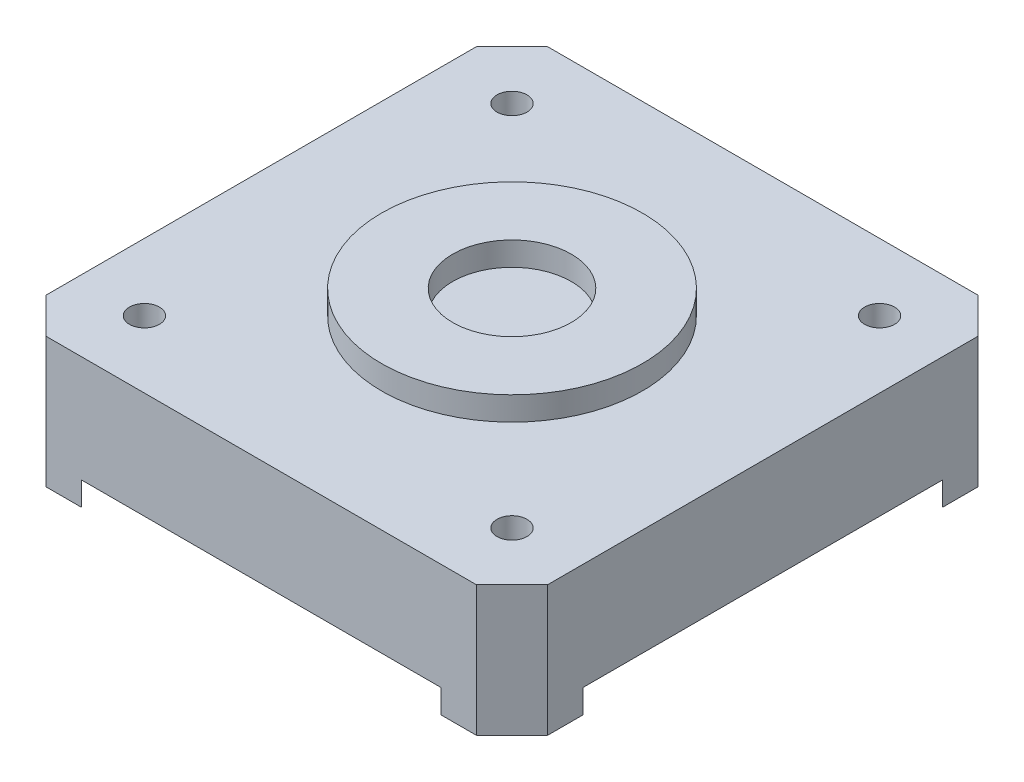
ISO-10303-21;
HEADER;
FILE_DESCRIPTION(('STEP AP214'),'2;1');
FILE_NAME('part.step','',(''),(''),'','','');
FILE_SCHEMA(('AUTOMOTIVE_DESIGN { 1 0 10303 214 1 1 1 1 }'));
ENDSEC;
DATA;
#1=APPLICATION_CONTEXT('core data for automotive mechanical design processes');
#2=APPLICATION_PROTOCOL_DEFINITION('international standard','automotive_design',2000,#1);
#3=PRODUCT_CONTEXT('',#1,'mechanical');
#4=PRODUCT('Part','Part','',(#3));
#5=PRODUCT_RELATED_PRODUCT_CATEGORY('part','',(#4));
#6=PRODUCT_DEFINITION_FORMATION('','',#4);
#7=PRODUCT_DEFINITION_CONTEXT('part definition',#1,'design');
#8=PRODUCT_DEFINITION('design','',#6,#7);
#9=PRODUCT_DEFINITION_SHAPE('','',#8);
#10=(LENGTH_UNIT() NAMED_UNIT(*) SI_UNIT(.MILLI.,.METRE.));
#11=(NAMED_UNIT(*) PLANE_ANGLE_UNIT() SI_UNIT($,.RADIAN.));
#12=(NAMED_UNIT(*) SI_UNIT($,.STERADIAN.) SOLID_ANGLE_UNIT());
#13=UNCERTAINTY_MEASURE_WITH_UNIT(LENGTH_MEASURE(1.E-05),#10,'distance_accuracy_value','');
#14=(GEOMETRIC_REPRESENTATION_CONTEXT(3) GLOBAL_UNCERTAINTY_ASSIGNED_CONTEXT((#13)) GLOBAL_UNIT_ASSIGNED_CONTEXT((#10,
#11,#12)) REPRESENTATION_CONTEXT('',''));
#15=CARTESIAN_POINT('',(0.,0.,0.));
#16=DIRECTION('',(0.,0.,1.));
#17=DIRECTION('',(1.,0.,0.));
#18=AXIS2_PLACEMENT_3D('',#15,#16,#17);
#19=CARTESIAN_POINT('',(0.,40.,0.));
#20=DIRECTION('',(0.,1.,0.));
#21=DIRECTION('',(1.,0.,0.));
#22=AXIS2_PLACEMENT_3D('',#19,#20,#21);
#23=PLANE('',#22);
#24=CARTESIAN_POINT('',(0.,40.,0.));
#25=DIRECTION('',(0.,1.,0.));
#26=DIRECTION('',(1.,0.,0.));
#27=AXIS2_PLACEMENT_3D('',#24,#25,#26);
#28=CIRCLE('',#27,5.);
#29=CARTESIAN_POINT('',(-5.,40.,0.));
#30=VERTEX_POINT('',#29);
#31=EDGE_CURVE('E339',#30,#30,#28,.T.);
#32=ORIENTED_EDGE('',*,*,#31,.T.);
#33=EDGE_LOOP('',(#32));
#34=FACE_BOUND('',#33,.T.);
#35=ADVANCED_FACE('F16',(#34),#23,.T.);
#36=CARTESIAN_POINT('',(0.,31.,0.));
#37=DIRECTION('',(0.,1.,0.));
#38=DIRECTION('',(1.,0.,0.));
#39=AXIS2_PLACEMENT_3D('',#36,#37,#38);
#40=PLANE('',#39);
#41=DIRECTION('',(0.707106781186548,0.,0.707106781186548));
#42=VECTOR('',#41,1.);
#43=CARTESIAN_POINT('',(-16.65,31.,19.65));
#44=LINE('',#43,#42);
#45=CARTESIAN_POINT('',(-21.15,31.,15.15));
#46=VERTEX_POINT('',#45);
#47=CARTESIAN_POINT('',(-15.15,31.,21.15));
#48=VERTEX_POINT('',#47);
#49=EDGE_CURVE('E400',#46,#48,#44,.T.);
#50=ORIENTED_EDGE('',*,*,#49,.F.);
#51=DIRECTION('',(0.,0.,1.));
#52=VECTOR('',#51,1.);
#53=CARTESIAN_POINT('',(-21.15,31.,-18.15));
#54=LINE('',#53,#52);
#55=CARTESIAN_POINT('',(-21.15,31.,-15.15));
#56=VERTEX_POINT('',#55);
#57=EDGE_CURVE('E354',#56,#46,#54,.T.);
#58=ORIENTED_EDGE('',*,*,#57,.F.);
#59=DIRECTION('',(-0.707106781186548,0.,0.707106781186548));
#60=VECTOR('',#59,1.);
#61=CARTESIAN_POINT('',(-19.65,31.,-16.65));
#62=LINE('',#61,#60);
#63=CARTESIAN_POINT('',(-15.15,31.,-21.15));
#64=VERTEX_POINT('',#63);
#65=EDGE_CURVE('E288',#64,#56,#62,.T.);
#66=ORIENTED_EDGE('',*,*,#65,.F.);
#67=DIRECTION('',(-1.,0.,0.));
#68=VECTOR('',#67,1.);
#69=CARTESIAN_POINT('',(18.15,31.,-21.15));
#70=LINE('',#69,#68);
#71=CARTESIAN_POINT('',(15.15,31.,-21.15));
#72=VERTEX_POINT('',#71);
#73=EDGE_CURVE('E11',#72,#64,#70,.T.);
#74=ORIENTED_EDGE('',*,*,#73,.F.);
#75=DIRECTION('',(-0.707106781186548,0.,-0.707106781186548));
#76=VECTOR('',#75,1.);
#77=CARTESIAN_POINT('',(16.65,31.,-19.65));
#78=LINE('',#77,#76);
#79=CARTESIAN_POINT('',(21.15,31.,-15.15));
#80=VERTEX_POINT('',#79);
#81=EDGE_CURVE('E378',#80,#72,#78,.T.);
#82=ORIENTED_EDGE('',*,*,#81,.F.);
#83=DIRECTION('',(0.,0.,-1.));
#84=VECTOR('',#83,1.);
#85=CARTESIAN_POINT('',(21.15,31.,18.15));
#86=LINE('',#85,#84);
#87=CARTESIAN_POINT('',(21.15,31.,15.15));
#88=VERTEX_POINT('',#87);
#89=EDGE_CURVE('E309',#88,#80,#86,.T.);
#90=ORIENTED_EDGE('',*,*,#89,.F.);
#91=DIRECTION('',(0.707106781186548,0.,-0.707106781186548));
#92=VECTOR('',#91,1.);
#93=CARTESIAN_POINT('',(19.65,31.,16.65));
#94=LINE('',#93,#92);
#95=CARTESIAN_POINT('',(15.15,31.,21.15));
#96=VERTEX_POINT('',#95);
#97=EDGE_CURVE('E20',#96,#88,#94,.T.);
#98=ORIENTED_EDGE('',*,*,#97,.F.);
#99=DIRECTION('',(1.,0.,0.));
#100=VECTOR('',#99,1.);
#101=CARTESIAN_POINT('',(-18.15,31.,21.15));
#102=LINE('',#101,#100);
#103=EDGE_CURVE('E326',#48,#96,#102,.T.);
#104=ORIENTED_EDGE('',*,*,#103,.F.);
#105=EDGE_LOOP('',(#50,#58,#66,#74,#82,#90,#98,#104));
#106=FACE_BOUND('',#105,.T.);
#107=ADVANCED_FACE('F558',(#106),#40,.F.);
#108=CARTESIAN_POINT('',(21.15,40.,-18.15));
#109=DIRECTION('',(-0.707106781186564,0.,0.707106781186531));
#110=DIRECTION('',(0.,1.,0.));
#111=AXIS2_PLACEMENT_3D('',#108,#109,#110);
#112=PLANE('',#111);
#113=DIRECTION('',(-0.707106781186531,0.,-0.707106781186564));
#114=VECTOR('',#113,1.);
#115=CARTESIAN_POINT('',(21.15,40.,-18.15));
#116=LINE('',#115,#114);
#117=CARTESIAN_POINT('',(21.15,40.,-18.15));
#118=VERTEX_POINT('',#117);
#119=CARTESIAN_POINT('',(18.15,40.,-21.15));
#120=VERTEX_POINT('',#119);
#121=EDGE_CURVE('E346',#118,#120,#116,.T.);
#122=ORIENTED_EDGE('',*,*,#121,.F.);
#123=DIRECTION('',(0.,-1.,0.));
#124=VECTOR('',#123,1.);
#125=CARTESIAN_POINT('',(21.15,40.,-18.15));
#126=LINE('',#125,#124);
#127=CARTESIAN_POINT('',(21.15,29.,-18.15));
#128=VERTEX_POINT('',#127);
#129=EDGE_CURVE('E305',#118,#128,#126,.T.);
#130=ORIENTED_EDGE('',*,*,#129,.T.);
#131=DIRECTION('',(-0.707106781186531,0.,-0.707106781186564));
#132=VECTOR('',#131,1.);
#133=CARTESIAN_POINT('',(20.4,29.,-18.9));
#134=LINE('',#133,#132);
#135=CARTESIAN_POINT('',(18.15,29.,-21.15));
#136=VERTEX_POINT('',#135);
#137=EDGE_CURVE('E313',#128,#136,#134,.T.);
#138=ORIENTED_EDGE('',*,*,#137,.T.);
#139=DIRECTION('',(0.,-1.,0.));
#140=VECTOR('',#139,1.);
#141=CARTESIAN_POINT('',(18.15,40.,-21.15));
#142=LINE('',#141,#140);
#143=EDGE_CURVE('E27',#120,#136,#142,.T.);
#144=ORIENTED_EDGE('',*,*,#143,.F.);
#145=EDGE_LOOP('',(#122,#130,#138,#144));
#146=FACE_BOUND('',#145,.T.);
#147=ADVANCED_FACE('F511',(#146),#112,.F.);
#148=CARTESIAN_POINT('',(18.15,40.,-21.15));
#149=DIRECTION('',(0.,0.,1.));
#150=DIRECTION('',(1.,0.,0.));
#151=AXIS2_PLACEMENT_3D('',#148,#149,#150);
#152=PLANE('',#151);
#153=DIRECTION('',(-1.,0.,0.));
#154=VECTOR('',#153,1.);
#155=CARTESIAN_POINT('',(18.15,40.,-21.15));
#156=LINE('',#155,#154);
#157=CARTESIAN_POINT('',(-18.15,40.,-21.15));
#158=VERTEX_POINT('',#157);
#159=EDGE_CURVE('E349',#120,#158,#156,.T.);
#160=ORIENTED_EDGE('',*,*,#159,.F.);
#161=ORIENTED_EDGE('',*,*,#143,.T.);
#162=DIRECTION('',(-1.,0.,0.));
#163=VECTOR('',#162,1.);
#164=CARTESIAN_POINT('',(9.075,29.,-21.15));
#165=LINE('',#164,#163);
#166=CARTESIAN_POINT('',(15.15,29.,-21.15));
#167=VERTEX_POINT('',#166);
#168=EDGE_CURVE('E310',#136,#167,#165,.T.);
#169=ORIENTED_EDGE('',*,*,#168,.T.);
#170=DIRECTION('',(0.,-1.,0.));
#171=VECTOR('',#170,1.);
#172=CARTESIAN_POINT('',(15.15,31.,-21.15));
#173=LINE('',#172,#171);
#174=EDGE_CURVE('E382',#72,#167,#173,.T.);
#175=ORIENTED_EDGE('',*,*,#174,.F.);
#176=ORIENTED_EDGE('',*,*,#73,.T.);
#177=DIRECTION('',(0.,-1.,0.));
#178=VECTOR('',#177,1.);
#179=CARTESIAN_POINT('',(-15.15,31.,-21.15));
#180=LINE('',#179,#178);
#181=CARTESIAN_POINT('',(-15.15,29.,-21.15));
#182=VERTEX_POINT('',#181);
#183=EDGE_CURVE('E359',#64,#182,#180,.T.);
#184=ORIENTED_EDGE('',*,*,#183,.T.);
#185=DIRECTION('',(-1.,0.,0.));
#186=VECTOR('',#185,1.);
#187=CARTESIAN_POINT('',(-7.575,29.,-21.15));
#188=LINE('',#187,#186);
#189=CARTESIAN_POINT('',(-18.15,29.,-21.15));
#190=VERTEX_POINT('',#189);
#191=EDGE_CURVE('E294',#182,#190,#188,.T.);
#192=ORIENTED_EDGE('',*,*,#191,.T.);
#193=DIRECTION('',(0.,-1.,0.));
#194=VECTOR('',#193,1.);
#195=CARTESIAN_POINT('',(-18.15,40.,-21.15));
#196=LINE('',#195,#194);
#197=EDGE_CURVE('E351',#158,#190,#196,.T.);
#198=ORIENTED_EDGE('',*,*,#197,.F.);
#199=EDGE_LOOP('',(#160,#161,#169,#175,#176,#184,#192,#198));
#200=FACE_BOUND('',#199,.T.);
#201=ADVANCED_FACE('F514',(#200),#152,.F.);
#202=CARTESIAN_POINT('',(-18.15,40.,-21.15));
#203=DIRECTION('',(0.707106781186548,0.,0.707106781186548));
#204=DIRECTION('',(0.,-1.,0.));
#205=AXIS2_PLACEMENT_3D('',#202,#203,#204);
#206=PLANE('',#205);
#207=DIRECTION('',(0.707106781186548,0.,-0.707106781186548));
#208=VECTOR('',#207,1.);
#209=CARTESIAN_POINT('',(-21.15,40.,-18.15));
#210=LINE('',#209,#208);
#211=CARTESIAN_POINT('',(-21.15,40.,-18.15));
#212=VERTEX_POINT('',#211);
#213=EDGE_CURVE('E414',#212,#158,#210,.T.);
#214=ORIENTED_EDGE('',*,*,#213,.T.);
#215=ORIENTED_EDGE('',*,*,#197,.T.);
#216=DIRECTION('',(-0.707106781186548,0.,0.707106781186548));
#217=VECTOR('',#216,1.);
#218=CARTESIAN_POINT('',(-18.9,29.,-20.4));
#219=LINE('',#218,#217);
#220=CARTESIAN_POINT('',(-21.15,29.,-18.15));
#221=VERTEX_POINT('',#220);
#222=EDGE_CURVE('E299',#190,#221,#219,.T.);
#223=ORIENTED_EDGE('',*,*,#222,.T.);
#224=DIRECTION('',(0.,-1.,0.));
#225=VECTOR('',#224,1.);
#226=CARTESIAN_POINT('',(-21.15,40.,-18.15));
#227=LINE('',#226,#225);
#228=EDGE_CURVE('E371',#212,#221,#227,.T.);
#229=ORIENTED_EDGE('',*,*,#228,.F.);
#230=EDGE_LOOP('',(#214,#215,#223,#229));
#231=FACE_BOUND('',#230,.T.);
#232=ADVANCED_FACE('F634',(#231),#206,.F.);
#233=CARTESIAN_POINT('',(-21.15,40.,-18.15));
#234=DIRECTION('',(1.,0.,0.));
#235=DIRECTION('',(0.,1.,0.));
#236=AXIS2_PLACEMENT_3D('',#233,#234,#235);
#237=PLANE('',#236);
#238=DIRECTION('',(0.,0.,1.));
#239=VECTOR('',#238,1.);
#240=CARTESIAN_POINT('',(-21.15,40.,-18.15));
#241=LINE('',#240,#239);
#242=CARTESIAN_POINT('',(-21.15,40.,18.15));
#243=VERTEX_POINT('',#242);
#244=EDGE_CURVE('E460',#212,#243,#241,.T.);
#245=ORIENTED_EDGE('',*,*,#244,.F.);
#246=ORIENTED_EDGE('',*,*,#228,.T.);
#247=DIRECTION('',(0.,0.,1.));
#248=VECTOR('',#247,1.);
#249=CARTESIAN_POINT('',(-21.15,29.,-9.075));
#250=LINE('',#249,#248);
#251=CARTESIAN_POINT('',(-21.15,29.,-15.15));
#252=VERTEX_POINT('',#251);
#253=EDGE_CURVE('E298',#221,#252,#250,.T.);
#254=ORIENTED_EDGE('',*,*,#253,.T.);
#255=DIRECTION('',(0.,-1.,0.));
#256=VECTOR('',#255,1.);
#257=CARTESIAN_POINT('',(-21.15,31.,-15.15));
#258=LINE('',#257,#256);
#259=EDGE_CURVE('E292',#56,#252,#258,.T.);
#260=ORIENTED_EDGE('',*,*,#259,.F.);
#261=ORIENTED_EDGE('',*,*,#57,.T.);
#262=DIRECTION('',(0.,-1.,0.));
#263=VECTOR('',#262,1.);
#264=CARTESIAN_POINT('',(-21.15,31.,15.15));
#265=LINE('',#264,#263);
#266=CARTESIAN_POINT('',(-21.15,29.,15.15));
#267=VERTEX_POINT('',#266);
#268=EDGE_CURVE('E398',#46,#267,#265,.T.);
#269=ORIENTED_EDGE('',*,*,#268,.T.);
#270=DIRECTION('',(0.,0.,1.));
#271=VECTOR('',#270,1.);
#272=CARTESIAN_POINT('',(-21.15,29.,7.575));
#273=LINE('',#272,#271);
#274=CARTESIAN_POINT('',(-21.15,29.,18.15));
#275=VERTEX_POINT('',#274);
#276=EDGE_CURVE('E427',#267,#275,#273,.T.);
#277=ORIENTED_EDGE('',*,*,#276,.T.);
#278=DIRECTION('',(0.,-1.,0.));
#279=VECTOR('',#278,1.);
#280=CARTESIAN_POINT('',(-21.15,40.,18.15));
#281=LINE('',#280,#279);
#282=EDGE_CURVE('E330',#243,#275,#281,.T.);
#283=ORIENTED_EDGE('',*,*,#282,.F.);
#284=EDGE_LOOP('',(#245,#246,#254,#260,#261,#269,#277,#283));
#285=FACE_BOUND('',#284,.T.);
#286=ADVANCED_FACE('F631',(#285),#237,.F.);
#287=CARTESIAN_POINT('',(-21.15,40.,18.15));
#288=DIRECTION('',(0.707106781186548,0.,-0.707106781186548));
#289=DIRECTION('',(0.,-1.,0.));
#290=AXIS2_PLACEMENT_3D('',#287,#288,#289);
#291=PLANE('',#290);
#292=DIRECTION('',(0.707106781186548,0.,0.707106781186548));
#293=VECTOR('',#292,1.);
#294=CARTESIAN_POINT('',(-21.15,40.,18.15));
#295=LINE('',#294,#293);
#296=CARTESIAN_POINT('',(-18.15,40.,21.15));
#297=VERTEX_POINT('',#296);
#298=EDGE_CURVE('E444',#243,#297,#295,.T.);
#299=ORIENTED_EDGE('',*,*,#298,.F.);
#300=ORIENTED_EDGE('',*,*,#282,.T.);
#301=DIRECTION('',(0.707106781186548,0.,0.707106781186548));
#302=VECTOR('',#301,1.);
#303=CARTESIAN_POINT('',(-20.4,29.,18.9));
#304=LINE('',#303,#302);
#305=CARTESIAN_POINT('',(-18.15,29.,21.15));
#306=VERTEX_POINT('',#305);
#307=EDGE_CURVE('E293',#275,#306,#304,.T.);
#308=ORIENTED_EDGE('',*,*,#307,.T.);
#309=DIRECTION('',(0.,-1.,0.));
#310=VECTOR('',#309,1.);
#311=CARTESIAN_POINT('',(-18.15,40.,21.15));
#312=LINE('',#311,#310);
#313=EDGE_CURVE('E323',#297,#306,#312,.T.);
#314=ORIENTED_EDGE('',*,*,#313,.F.);
#315=EDGE_LOOP('',(#299,#300,#308,#314));
#316=FACE_BOUND('',#315,.T.);
#317=ADVANCED_FACE('F493',(#316),#291,.F.);
#318=CARTESIAN_POINT('',(-18.15,40.,21.15));
#319=DIRECTION('',(0.,0.,-1.));
#320=DIRECTION('',(0.,-1.,0.));
#321=AXIS2_PLACEMENT_3D('',#318,#319,#320);
#322=PLANE('',#321);
#323=DIRECTION('',(1.,0.,0.));
#324=VECTOR('',#323,1.);
#325=CARTESIAN_POINT('',(-18.15,40.,21.15));
#326=LINE('',#325,#324);
#327=CARTESIAN_POINT('',(18.15,40.,21.15));
#328=VERTEX_POINT('',#327);
#329=EDGE_CURVE('E287',#297,#328,#326,.T.);
#330=ORIENTED_EDGE('',*,*,#329,.F.);
#331=ORIENTED_EDGE('',*,*,#313,.T.);
#332=DIRECTION('',(1.,0.,0.));
#333=VECTOR('',#332,1.);
#334=CARTESIAN_POINT('',(-9.075,29.,21.15));
#335=LINE('',#334,#333);
#336=CARTESIAN_POINT('',(-15.15,29.,21.15));
#337=VERTEX_POINT('',#336);
#338=EDGE_CURVE('E318',#306,#337,#335,.T.);
#339=ORIENTED_EDGE('',*,*,#338,.T.);
#340=DIRECTION('',(0.,-1.,0.));
#341=VECTOR('',#340,1.);
#342=CARTESIAN_POINT('',(-15.15,31.,21.15));
#343=LINE('',#342,#341);
#344=EDGE_CURVE('E399',#48,#337,#343,.T.);
#345=ORIENTED_EDGE('',*,*,#344,.F.);
#346=ORIENTED_EDGE('',*,*,#103,.T.);
#347=DIRECTION('',(0.,-1.,0.));
#348=VECTOR('',#347,1.);
#349=CARTESIAN_POINT('',(15.15,31.,21.15));
#350=LINE('',#349,#348);
#351=CARTESIAN_POINT('',(15.15,29.,21.15));
#352=VERTEX_POINT('',#351);
#353=EDGE_CURVE('E322',#96,#352,#350,.T.);
#354=ORIENTED_EDGE('',*,*,#353,.T.);
#355=DIRECTION('',(1.,0.,0.));
#356=VECTOR('',#355,1.);
#357=CARTESIAN_POINT('',(7.575,29.,21.15));
#358=LINE('',#357,#356);
#359=CARTESIAN_POINT('',(18.15,29.,21.15));
#360=VERTEX_POINT('',#359);
#361=EDGE_CURVE('E393',#352,#360,#358,.T.);
#362=ORIENTED_EDGE('',*,*,#361,.T.);
#363=DIRECTION('',(0.,-1.,0.));
#364=VECTOR('',#363,1.);
#365=CARTESIAN_POINT('',(18.15,40.,21.15));
#366=LINE('',#365,#364);
#367=EDGE_CURVE('E308',#328,#360,#366,.T.);
#368=ORIENTED_EDGE('',*,*,#367,.F.);
#369=EDGE_LOOP('',(#330,#331,#339,#345,#346,#354,#362,#368));
#370=FACE_BOUND('',#369,.T.);
#371=ADVANCED_FACE('F498',(#370),#322,.F.);
#372=CARTESIAN_POINT('',(18.15,40.,21.15));
#373=DIRECTION('',(-0.707106781186564,0.,-0.707106781186531));
#374=DIRECTION('',(-0.707106781186531,0.,0.707106781186564));
#375=AXIS2_PLACEMENT_3D('',#372,#373,#374);
#376=PLANE('',#375);
#377=DIRECTION('',(-0.707106781186531,0.,0.707106781186564));
#378=VECTOR('',#377,1.);
#379=CARTESIAN_POINT('',(21.15,40.,18.15));
#380=LINE('',#379,#378);
#381=CARTESIAN_POINT('',(21.15,40.,18.15));
#382=VERTEX_POINT('',#381);
#383=EDGE_CURVE('E282',#382,#328,#380,.T.);
#384=ORIENTED_EDGE('',*,*,#383,.T.);
#385=ORIENTED_EDGE('',*,*,#367,.T.);
#386=DIRECTION('',(0.707106781186531,0.,-0.707106781186564));
#387=VECTOR('',#386,1.);
#388=CARTESIAN_POINT('',(18.9000000000003,29.,20.4));
#389=LINE('',#388,#387);
#390=CARTESIAN_POINT('',(21.15,29.,18.15));
#391=VERTEX_POINT('',#390);
#392=EDGE_CURVE('E370',#360,#391,#389,.T.);
#393=ORIENTED_EDGE('',*,*,#392,.T.);
#394=DIRECTION('',(0.,-1.,0.));
#395=VECTOR('',#394,1.);
#396=CARTESIAN_POINT('',(21.15,40.,18.15));
#397=LINE('',#396,#395);
#398=EDGE_CURVE('E421',#382,#391,#397,.T.);
#399=ORIENTED_EDGE('',*,*,#398,.F.);
#400=EDGE_LOOP('',(#384,#385,#393,#399));
#401=FACE_BOUND('',#400,.T.);
#402=ADVANCED_FACE('F503',(#401),#376,.F.);
#403=CARTESIAN_POINT('',(21.15,40.,18.15));
#404=DIRECTION('',(-1.,0.,0.));
#405=DIRECTION('',(0.,0.,1.));
#406=AXIS2_PLACEMENT_3D('',#403,#404,#405);
#407=PLANE('',#406);
#408=DIRECTION('',(0.,0.,-1.));
#409=VECTOR('',#408,1.);
#410=CARTESIAN_POINT('',(21.15,40.,18.15));
#411=LINE('',#410,#409);
#412=EDGE_CURVE('E286',#382,#118,#411,.T.);
#413=ORIENTED_EDGE('',*,*,#412,.F.);
#414=ORIENTED_EDGE('',*,*,#398,.T.);
#415=DIRECTION('',(0.,0.,-1.));
#416=VECTOR('',#415,1.);
#417=CARTESIAN_POINT('',(21.15,29.,9.075));
#418=LINE('',#417,#416);
#419=CARTESIAN_POINT('',(21.15,29.,15.15));
#420=VERTEX_POINT('',#419);
#421=EDGE_CURVE('E383',#391,#420,#418,.T.);
#422=ORIENTED_EDGE('',*,*,#421,.T.);
#423=DIRECTION('',(0.,-1.,0.));
#424=VECTOR('',#423,1.);
#425=CARTESIAN_POINT('',(21.15,31.,15.15));
#426=LINE('',#425,#424);
#427=EDGE_CURVE('E300',#88,#420,#426,.T.);
#428=ORIENTED_EDGE('',*,*,#427,.F.);
#429=ORIENTED_EDGE('',*,*,#89,.T.);
#430=DIRECTION('',(0.,-1.,0.));
#431=VECTOR('',#430,1.);
#432=CARTESIAN_POINT('',(21.15,31.,-15.15));
#433=LINE('',#432,#431);
#434=CARTESIAN_POINT('',(21.15,29.,-15.15));
#435=VERTEX_POINT('',#434);
#436=EDGE_CURVE('E418',#80,#435,#433,.T.);
#437=ORIENTED_EDGE('',*,*,#436,.T.);
#438=DIRECTION('',(0.,0.,-1.));
#439=VECTOR('',#438,1.);
#440=CARTESIAN_POINT('',(21.15,29.,-7.575));
#441=LINE('',#440,#439);
#442=EDGE_CURVE('E314',#435,#128,#441,.T.);
#443=ORIENTED_EDGE('',*,*,#442,.T.);
#444=ORIENTED_EDGE('',*,*,#129,.F.);
#445=EDGE_LOOP('',(#413,#414,#422,#428,#429,#437,#443,#444));
#446=FACE_BOUND('',#445,.T.);
#447=ADVANCED_FACE('F651',(#446),#407,.F.);
#448=CARTESIAN_POINT('',(0.,29.,0.));
#449=DIRECTION('',(0.,1.,0.));
#450=DIRECTION('',(1.,0.,0.));
#451=AXIS2_PLACEMENT_3D('',#448,#449,#450);
#452=PLANE('',#451);
#453=ORIENTED_EDGE('',*,*,#442,.F.);
#454=DIRECTION('',(0.707106781186548,0.,0.707106781186548));
#455=VECTOR('',#454,1.);
#456=CARTESIAN_POINT('',(16.65,29.,-19.65));
#457=LINE('',#456,#455);
#458=EDGE_CURVE('E387',#167,#435,#457,.T.);
#459=ORIENTED_EDGE('',*,*,#458,.F.);
#460=ORIENTED_EDGE('',*,*,#168,.F.);
#461=ORIENTED_EDGE('',*,*,#137,.F.);
#462=EDGE_LOOP('',(#453,#459,#460,#461));
#463=FACE_BOUND('',#462,.T.);
#464=ADVANCED_FACE('F639',(#463),#452,.F.);
#465=CARTESIAN_POINT('',(15.15,31.,-21.15));
#466=DIRECTION('',(0.707106781186548,0.,-0.707106781186548));
#467=DIRECTION('',(0.,-1.,0.));
#468=AXIS2_PLACEMENT_3D('',#465,#466,#467);
#469=PLANE('',#468);
#470=ORIENTED_EDGE('',*,*,#81,.T.);
#471=ORIENTED_EDGE('',*,*,#174,.T.);
#472=ORIENTED_EDGE('',*,*,#458,.T.);
#473=ORIENTED_EDGE('',*,*,#436,.F.);
#474=EDGE_LOOP('',(#470,#471,#472,#473));
#475=FACE_BOUND('',#474,.T.);
#476=ADVANCED_FACE('F635',(#475),#469,.F.);
#477=CARTESIAN_POINT('',(0.,29.,0.));
#478=DIRECTION('',(0.,1.,0.));
#479=DIRECTION('',(1.,0.,0.));
#480=AXIS2_PLACEMENT_3D('',#477,#478,#479);
#481=PLANE('',#480);
#482=ORIENTED_EDGE('',*,*,#392,.F.);
#483=ORIENTED_EDGE('',*,*,#361,.F.);
#484=DIRECTION('',(-0.707106781186548,0.,0.707106781186548));
#485=VECTOR('',#484,1.);
#486=CARTESIAN_POINT('',(19.65,29.,16.65));
#487=LINE('',#486,#485);
#488=EDGE_CURVE('E304',#420,#352,#487,.T.);
#489=ORIENTED_EDGE('',*,*,#488,.F.);
#490=ORIENTED_EDGE('',*,*,#421,.F.);
#491=EDGE_LOOP('',(#482,#483,#489,#490));
#492=FACE_BOUND('',#491,.T.);
#493=ADVANCED_FACE('F638',(#492),#481,.F.);
#494=CARTESIAN_POINT('',(21.15,31.,15.15));
#495=DIRECTION('',(0.707106781186548,0.,0.707106781186548));
#496=DIRECTION('',(0.,-1.,0.));
#497=AXIS2_PLACEMENT_3D('',#494,#495,#496);
#498=PLANE('',#497);
#499=ORIENTED_EDGE('',*,*,#97,.T.);
#500=ORIENTED_EDGE('',*,*,#427,.T.);
#501=ORIENTED_EDGE('',*,*,#488,.T.);
#502=ORIENTED_EDGE('',*,*,#353,.F.);
#503=EDGE_LOOP('',(#499,#500,#501,#502));
#504=FACE_BOUND('',#503,.T.);
#505=ADVANCED_FACE('F659',(#504),#498,.F.);
#506=CARTESIAN_POINT('',(0.,29.,0.));
#507=DIRECTION('',(0.,1.,0.));
#508=DIRECTION('',(1.,0.,0.));
#509=AXIS2_PLACEMENT_3D('',#506,#507,#508);
#510=PLANE('',#509);
#511=ORIENTED_EDGE('',*,*,#222,.F.);
#512=ORIENTED_EDGE('',*,*,#191,.F.);
#513=DIRECTION('',(0.707106781186548,0.,-0.707106781186548));
#514=VECTOR('',#513,1.);
#515=CARTESIAN_POINT('',(-19.65,29.,-16.65));
#516=LINE('',#515,#514);
#517=EDGE_CURVE('E355',#252,#182,#516,.T.);
#518=ORIENTED_EDGE('',*,*,#517,.F.);
#519=ORIENTED_EDGE('',*,*,#253,.F.);
#520=EDGE_LOOP('',(#511,#512,#518,#519));
#521=FACE_BOUND('',#520,.T.);
#522=ADVANCED_FACE('F577',(#521),#510,.F.);
#523=CARTESIAN_POINT('',(-21.15,31.,-15.15));
#524=DIRECTION('',(-0.707106781186548,0.,-0.707106781186548));
#525=DIRECTION('',(-0.707106781186548,0.,0.707106781186548));
#526=AXIS2_PLACEMENT_3D('',#523,#524,#525);
#527=PLANE('',#526);
#528=ORIENTED_EDGE('',*,*,#65,.T.);
#529=ORIENTED_EDGE('',*,*,#259,.T.);
#530=ORIENTED_EDGE('',*,*,#517,.T.);
#531=ORIENTED_EDGE('',*,*,#183,.F.);
#532=EDGE_LOOP('',(#528,#529,#530,#531));
#533=FACE_BOUND('',#532,.T.);
#534=ADVANCED_FACE('F584',(#533),#527,.F.);
#535=CARTESIAN_POINT('',(0.,29.,0.));
#536=DIRECTION('',(0.,1.,0.));
#537=DIRECTION('',(1.,0.,0.));
#538=AXIS2_PLACEMENT_3D('',#535,#536,#537);
#539=PLANE('',#538);
#540=ORIENTED_EDGE('',*,*,#276,.F.);
#541=DIRECTION('',(-0.707106781186548,0.,-0.707106781186548));
#542=VECTOR('',#541,1.);
#543=CARTESIAN_POINT('',(-16.65,29.,19.65));
#544=LINE('',#543,#542);
#545=EDGE_CURVE('E394',#337,#267,#544,.T.);
#546=ORIENTED_EDGE('',*,*,#545,.F.);
#547=ORIENTED_EDGE('',*,*,#338,.F.);
#548=ORIENTED_EDGE('',*,*,#307,.F.);
#549=EDGE_LOOP('',(#540,#546,#547,#548));
#550=FACE_BOUND('',#549,.T.);
#551=ADVANCED_FACE('F552',(#550),#539,.F.);
#552=CARTESIAN_POINT('',(-15.15,31.,21.15));
#553=DIRECTION('',(-0.707106781186548,0.,0.707106781186548));
#554=DIRECTION('',(0.,1.,0.));
#555=AXIS2_PLACEMENT_3D('',#552,#553,#554);
#556=PLANE('',#555);
#557=ORIENTED_EDGE('',*,*,#49,.T.);
#558=ORIENTED_EDGE('',*,*,#344,.T.);
#559=ORIENTED_EDGE('',*,*,#545,.T.);
#560=ORIENTED_EDGE('',*,*,#268,.F.);
#561=EDGE_LOOP('',(#557,#558,#559,#560));
#562=FACE_BOUND('',#561,.T.);
#563=ADVANCED_FACE('F18',(#562),#556,.F.);
#564=CARTESIAN_POINT('',(0.,40.,0.));
#565=DIRECTION('',(0.,1.,0.));
#566=DIRECTION('',(1.,0.,0.));
#567=AXIS2_PLACEMENT_3D('',#564,#565,#566);
#568=PLANE('',#567);
#569=CARTESIAN_POINT('',(0.,40.,0.));
#570=DIRECTION('',(0.,-1.,0.));
#571=DIRECTION('',(1.,0.,0.));
#572=AXIS2_PLACEMENT_3D('',#569,#570,#571);
#573=CIRCLE('',#572,11.);
#574=CARTESIAN_POINT('',(-11.,40.,0.));
#575=VERTEX_POINT('',#574);
#576=EDGE_CURVE('E279',#575,#575,#573,.T.);
#577=ORIENTED_EDGE('',*,*,#576,.T.);
#578=EDGE_LOOP('',(#577));
#579=FACE_BOUND('',#578,.T.);
#580=CARTESIAN_POINT('',(-15.5,40.,15.5));
#581=DIRECTION('',(0.,-1.,0.));
#582=DIRECTION('',(0.,0.,1.));
#583=AXIS2_PLACEMENT_3D('',#580,#581,#582);
#584=CIRCLE('',#583,1.2645);
#585=CARTESIAN_POINT('',(-15.5,40.,16.7645));
#586=VERTEX_POINT('',#585);
#587=CARTESIAN_POINT('',(-15.5,40.,14.2355));
#588=VERTEX_POINT('',#587);
#589=EDGE_CURVE('E437',#586,#588,#584,.T.);
#590=ORIENTED_EDGE('',*,*,#589,.T.);
#591=CARTESIAN_POINT('',(-15.5,40.,15.5));
#592=DIRECTION('',(0.,-1.,0.));
#593=DIRECTION('',(0.,0.,1.));
#594=AXIS2_PLACEMENT_3D('',#591,#592,#593);
#595=CIRCLE('',#594,1.2645);
#596=EDGE_CURVE('E541',#588,#586,#595,.T.);
#597=ORIENTED_EDGE('',*,*,#596,.T.);
#598=EDGE_LOOP('',(#590,#597));
#599=FACE_BOUND('',#598,.T.);
#600=CARTESIAN_POINT('',(15.5,40.,-15.5));
#601=DIRECTION('',(0.,-1.,0.));
#602=DIRECTION('',(0.,0.,1.));
#603=AXIS2_PLACEMENT_3D('',#600,#601,#602);
#604=CIRCLE('',#603,1.2645);
#605=CARTESIAN_POINT('',(15.5,40.,-14.2355));
#606=VERTEX_POINT('',#605);
#607=CARTESIAN_POINT('',(15.5,40.,-16.7645));
#608=VERTEX_POINT('',#607);
#609=EDGE_CURVE('E433',#606,#608,#604,.T.);
#610=ORIENTED_EDGE('',*,*,#609,.T.);
#611=CARTESIAN_POINT('',(15.5,40.,-15.5));
#612=DIRECTION('',(0.,-1.,0.));
#613=DIRECTION('',(0.,0.,1.));
#614=AXIS2_PLACEMENT_3D('',#611,#612,#613);
#615=CIRCLE('',#614,1.2645);
#616=EDGE_CURVE('E211',#608,#606,#615,.T.);
#617=ORIENTED_EDGE('',*,*,#616,.T.);
#618=EDGE_LOOP('',(#610,#617));
#619=FACE_BOUND('',#618,.T.);
#620=CARTESIAN_POINT('',(-15.5,40.,-15.5));
#621=DIRECTION('',(0.,-1.,0.));
#622=DIRECTION('',(0.,0.,1.));
#623=AXIS2_PLACEMENT_3D('',#620,#621,#622);
#624=CIRCLE('',#623,1.2645);
#625=CARTESIAN_POINT('',(-15.5,40.,-14.2355));
#626=VERTEX_POINT('',#625);
#627=CARTESIAN_POINT('',(-15.5,40.,-16.7645));
#628=VERTEX_POINT('',#627);
#629=EDGE_CURVE('E265',#626,#628,#624,.T.);
#630=ORIENTED_EDGE('',*,*,#629,.T.);
#631=CARTESIAN_POINT('',(-15.5,40.,-15.5));
#632=DIRECTION('',(0.,-1.,0.));
#633=DIRECTION('',(0.,0.,1.));
#634=AXIS2_PLACEMENT_3D('',#631,#632,#633);
#635=CIRCLE('',#634,1.2645);
#636=EDGE_CURVE('E255',#628,#626,#635,.T.);
#637=ORIENTED_EDGE('',*,*,#636,.T.);
#638=EDGE_LOOP('',(#630,#637));
#639=FACE_BOUND('',#638,.T.);
#640=CARTESIAN_POINT('',(15.5,40.,15.5));
#641=DIRECTION('',(0.,-1.,0.));
#642=DIRECTION('',(0.,0.,1.));
#643=AXIS2_PLACEMENT_3D('',#640,#641,#642);
#644=CIRCLE('',#643,1.2645);
#645=CARTESIAN_POINT('',(15.5,40.,16.7645));
#646=VERTEX_POINT('',#645);
#647=CARTESIAN_POINT('',(15.5,40.,14.2355));
#648=VERTEX_POINT('',#647);
#649=EDGE_CURVE('E364',#646,#648,#644,.T.);
#650=ORIENTED_EDGE('',*,*,#649,.T.);
#651=CARTESIAN_POINT('',(15.5,40.,15.5));
#652=DIRECTION('',(0.,-1.,0.));
#653=DIRECTION('',(0.,0.,1.));
#654=AXIS2_PLACEMENT_3D('',#651,#652,#653);
#655=CIRCLE('',#654,1.2645);
#656=EDGE_CURVE('E276',#648,#646,#655,.T.);
#657=ORIENTED_EDGE('',*,*,#656,.T.);
#658=EDGE_LOOP('',(#650,#657));
#659=FACE_BOUND('',#658,.T.);
#660=ORIENTED_EDGE('',*,*,#121,.T.);
#661=ORIENTED_EDGE('',*,*,#159,.T.);
#662=ORIENTED_EDGE('',*,*,#213,.F.);
#663=ORIENTED_EDGE('',*,*,#244,.T.);
#664=ORIENTED_EDGE('',*,*,#298,.T.);
#665=ORIENTED_EDGE('',*,*,#329,.T.);
#666=ORIENTED_EDGE('',*,*,#383,.F.);
#667=ORIENTED_EDGE('',*,*,#412,.T.);
#668=EDGE_LOOP('',(#660,#661,#662,#663,#664,#665,#666,#667));
#669=FACE_BOUND('',#668,.T.);
#670=ADVANCED_FACE('F485',(#579,#599,#619,#639,#659,#669),#568,.T.);
#671=CARTESIAN_POINT('',(0.,42.,0.));
#672=DIRECTION('',(0.,1.,0.));
#673=DIRECTION('',(1.,0.,0.));
#674=AXIS2_PLACEMENT_3D('',#671,#672,#673);
#675=PLANE('',#674);
#676=CARTESIAN_POINT('',(0.,42.,0.));
#677=DIRECTION('',(0.,-1.,0.));
#678=DIRECTION('',(1.,0.,0.));
#679=AXIS2_PLACEMENT_3D('',#676,#677,#678);
#680=CIRCLE('',#679,5.);
#681=CARTESIAN_POINT('',(-5.,42.,0.));
#682=VERTEX_POINT('',#681);
#683=EDGE_CURVE('E340',#682,#682,#680,.T.);
#684=ORIENTED_EDGE('',*,*,#683,.T.);
#685=EDGE_LOOP('',(#684));
#686=FACE_BOUND('',#685,.T.);
#687=CARTESIAN_POINT('',(0.,42.,0.));
#688=DIRECTION('',(0.,1.,0.));
#689=DIRECTION('',(1.,0.,0.));
#690=AXIS2_PLACEMENT_3D('',#687,#688,#689);
#691=CIRCLE('',#690,11.);
#692=CARTESIAN_POINT('',(-11.,42.,0.));
#693=VERTEX_POINT('',#692);
#694=EDGE_CURVE('E334',#693,#693,#691,.T.);
#695=ORIENTED_EDGE('',*,*,#694,.T.);
#696=EDGE_LOOP('',(#695));
#697=FACE_BOUND('',#696,.T.);
#698=ADVANCED_FACE('F905',(#686,#697),#675,.T.);
#699=CARTESIAN_POINT('',(0.,40.,0.));
#700=DIRECTION('',(0.,1.,0.));
#701=DIRECTION('',(1.,0.,0.));
#702=AXIS2_PLACEMENT_3D('',#699,#700,#701);
#703=CYLINDRICAL_SURFACE('',#702,11.);
#704=ORIENTED_EDGE('',*,*,#694,.F.);
#705=DIRECTION('',(0.,-1.,0.));
#706=VECTOR('',#705,1.);
#707=CARTESIAN_POINT('',(-11.,40.,0.));
#708=LINE('',#707,#706);
#709=EDGE_CURVE('E338',#693,#575,#708,.T.);
#710=ORIENTED_EDGE('',*,*,#709,.T.);
#711=ORIENTED_EDGE('',*,*,#576,.F.);
#712=ORIENTED_EDGE('',*,*,#709,.F.);
#713=EDGE_LOOP('',(#704,#710,#711,#712));
#714=FACE_BOUND('',#713,.T.);
#715=ADVANCED_FACE('F649',(#714),#703,.T.);
#716=CARTESIAN_POINT('',(0.,40.,0.));
#717=DIRECTION('',(0.,1.,0.));
#718=DIRECTION('',(1.,0.,0.));
#719=AXIS2_PLACEMENT_3D('',#716,#717,#718);
#720=CYLINDRICAL_SURFACE('',#719,5.);
#721=ORIENTED_EDGE('',*,*,#683,.F.);
#722=DIRECTION('',(0.,-1.,0.));
#723=VECTOR('',#722,1.);
#724=CARTESIAN_POINT('',(-5.,40.,0.));
#725=LINE('',#724,#723);
#726=EDGE_CURVE('E344',#682,#30,#725,.T.);
#727=ORIENTED_EDGE('',*,*,#726,.T.);
#728=ORIENTED_EDGE('',*,*,#31,.F.);
#729=ORIENTED_EDGE('',*,*,#726,.F.);
#730=EDGE_LOOP('',(#721,#727,#728,#729));
#731=FACE_BOUND('',#730,.T.);
#732=ADVANCED_FACE('F617',(#731),#720,.F.);
#733=CARTESIAN_POINT('',(-15.5,37.75,15.5));
#734=DIRECTION('',(0.,-1.,0.));
#735=DIRECTION('',(0.,0.,1.));
#736=AXIS2_PLACEMENT_3D('',#733,#734,#735);
#737=CYLINDRICAL_SURFACE('',#736,1.2645);
#738=ORIENTED_EDGE('',*,*,#589,.F.);
#739=ORIENTED_EDGE('',*,*,#596,.F.);
#740=DIRECTION('',(0.,-1.,0.));
#741=VECTOR('',#740,1.);
#742=CARTESIAN_POINT('',(-15.5,37.75,14.2355));
#743=LINE('',#742,#741);
#744=CARTESIAN_POINT('',(-15.5,35.5,14.2355));
#745=VERTEX_POINT('',#744);
#746=EDGE_CURVE('E345',#588,#745,#743,.T.);
#747=ORIENTED_EDGE('',*,*,#746,.T.);
#748=CARTESIAN_POINT('',(-15.5,35.5,15.5));
#749=DIRECTION('',(0.,-1.,0.));
#750=DIRECTION('',(0.,0.,1.));
#751=AXIS2_PLACEMENT_3D('',#748,#749,#750);
#752=CIRCLE('',#751,1.2645);
#753=CARTESIAN_POINT('',(-15.5,35.5,16.7645));
#754=VERTEX_POINT('',#753);
#755=EDGE_CURVE('E438',#745,#754,#752,.T.);
#756=ORIENTED_EDGE('',*,*,#755,.T.);
#757=CARTESIAN_POINT('',(-15.5,35.5,15.5));
#758=DIRECTION('',(0.,-1.,0.));
#759=DIRECTION('',(0.,0.,1.));
#760=AXIS2_PLACEMENT_3D('',#757,#758,#759);
#761=CIRCLE('',#760,1.2645);
#762=EDGE_CURVE('E377',#754,#745,#761,.T.);
#763=ORIENTED_EDGE('',*,*,#762,.T.);
#764=ORIENTED_EDGE('',*,*,#746,.F.);
#765=EDGE_LOOP('',(#738,#739,#747,#756,#763,#764));
#766=FACE_BOUND('',#765,.T.);
#767=ADVANCED_FACE('F601',(#766),#737,.F.);
#768=CARTESIAN_POINT('',(-15.5,35.1201058736198,15.5));
#769=DIRECTION('',(0.,1.,0.));
#770=DIRECTION('',(0.,0.,1.));
#771=AXIS2_PLACEMENT_3D('',#768,#769,#770);
#772=CONICAL_SURFACE('',#771,0.63225,1.02974425867665);
#773=ORIENTED_EDGE('',*,*,#762,.F.);
#774=ORIENTED_EDGE('',*,*,#755,.F.);
#775=DIRECTION('',(0.,-0.515038074910054,0.857167300702112));
#776=VECTOR('',#775,1.);
#777=CARTESIAN_POINT('',(-15.5,35.1201058736198,14.86775));
#778=LINE('',#777,#776);
#779=CARTESIAN_POINT('',(-15.5,34.7402117472396,15.5));
#780=VERTEX_POINT('',#779);
#781=EDGE_CURVE('E434',#745,#780,#778,.T.);
#782=ORIENTED_EDGE('',*,*,#781,.T.);
#783=ORIENTED_EDGE('',*,*,#781,.F.);
#784=EDGE_LOOP('',(#773,#774,#782,#783));
#785=FACE_BOUND('',#784,.T.);
#786=ADVANCED_FACE('F605',(#785),#772,.F.);
#787=CARTESIAN_POINT('',(15.5,37.75,-15.5));
#788=DIRECTION('',(0.,-1.,0.));
#789=DIRECTION('',(0.,0.,1.));
#790=AXIS2_PLACEMENT_3D('',#787,#788,#789);
#791=CYLINDRICAL_SURFACE('',#790,1.2645);
#792=ORIENTED_EDGE('',*,*,#609,.F.);
#793=ORIENTED_EDGE('',*,*,#616,.F.);
#794=DIRECTION('',(0.,-1.,0.));
#795=VECTOR('',#794,1.);
#796=CARTESIAN_POINT('',(15.5,37.75,-16.7645));
#797=LINE('',#796,#795);
#798=CARTESIAN_POINT('',(15.5,35.5,-16.7645));
#799=VERTEX_POINT('',#798);
#800=EDGE_CURVE('E374',#608,#799,#797,.T.);
#801=ORIENTED_EDGE('',*,*,#800,.T.);
#802=CARTESIAN_POINT('',(15.5,35.5,-15.5));
#803=DIRECTION('',(0.,-1.,0.));
#804=DIRECTION('',(0.,0.,1.));
#805=AXIS2_PLACEMENT_3D('',#802,#803,#804);
#806=CIRCLE('',#805,1.2645);
#807=CARTESIAN_POINT('',(15.5,35.5,-14.2355));
#808=VERTEX_POINT('',#807);
#809=EDGE_CURVE('E331',#799,#808,#806,.T.);
#810=ORIENTED_EDGE('',*,*,#809,.T.);
#811=CARTESIAN_POINT('',(15.5,35.5,-15.5));
#812=DIRECTION('',(0.,-1.,0.));
#813=DIRECTION('',(0.,0.,1.));
#814=AXIS2_PLACEMENT_3D('',#811,#812,#813);
#815=CIRCLE('',#814,1.2645);
#816=EDGE_CURVE('E258',#808,#799,#815,.T.);
#817=ORIENTED_EDGE('',*,*,#816,.T.);
#818=ORIENTED_EDGE('',*,*,#800,.F.);
#819=EDGE_LOOP('',(#792,#793,#801,#810,#817,#818));
#820=FACE_BOUND('',#819,.T.);
#821=ADVANCED_FACE('F607',(#820),#791,.F.);
#822=CARTESIAN_POINT('',(15.5,35.1201058736198,-15.5));
#823=DIRECTION('',(0.,1.,0.));
#824=DIRECTION('',(0.,0.,1.));
#825=AXIS2_PLACEMENT_3D('',#822,#823,#824);
#826=CONICAL_SURFACE('',#825,0.63225,1.02974425867665);
#827=ORIENTED_EDGE('',*,*,#816,.F.);
#828=ORIENTED_EDGE('',*,*,#809,.F.);
#829=DIRECTION('',(0.,-0.515038074910054,0.857167300702112));
#830=VECTOR('',#829,1.);
#831=CARTESIAN_POINT('',(15.5,35.1201058736198,-16.13225));
#832=LINE('',#831,#830);
#833=CARTESIAN_POINT('',(15.5,34.7402117472396,-15.5));
#834=VERTEX_POINT('',#833);
#835=EDGE_CURVE('E201',#799,#834,#832,.T.);
#836=ORIENTED_EDGE('',*,*,#835,.T.);
#837=ORIENTED_EDGE('',*,*,#835,.F.);
#838=EDGE_LOOP('',(#827,#828,#836,#837));
#839=FACE_BOUND('',#838,.T.);
#840=ADVANCED_FACE('F614',(#839),#826,.F.);
#841=CARTESIAN_POINT('',(-15.5,37.75,-15.5));
#842=DIRECTION('',(0.,-1.,0.));
#843=DIRECTION('',(0.,0.,1.));
#844=AXIS2_PLACEMENT_3D('',#841,#842,#843);
#845=CYLINDRICAL_SURFACE('',#844,1.2645);
#846=ORIENTED_EDGE('',*,*,#629,.F.);
#847=ORIENTED_EDGE('',*,*,#636,.F.);
#848=DIRECTION('',(0.,-1.,0.));
#849=VECTOR('',#848,1.);
#850=CARTESIAN_POINT('',(-15.5,37.75,-16.7645));
#851=LINE('',#850,#849);
#852=CARTESIAN_POINT('',(-15.5,35.5,-16.7645));
#853=VERTEX_POINT('',#852);
#854=EDGE_CURVE('E247',#628,#853,#851,.T.);
#855=ORIENTED_EDGE('',*,*,#854,.T.);
#856=CARTESIAN_POINT('',(-15.5,35.5,-15.5));
#857=DIRECTION('',(0.,-1.,0.));
#858=DIRECTION('',(0.,0.,1.));
#859=AXIS2_PLACEMENT_3D('',#856,#857,#858);
#860=CIRCLE('',#859,1.2645);
#861=CARTESIAN_POINT('',(-15.5,35.5,-14.2355));
#862=VERTEX_POINT('',#861);
#863=EDGE_CURVE('E253',#853,#862,#860,.T.);
#864=ORIENTED_EDGE('',*,*,#863,.T.);
#865=CARTESIAN_POINT('',(-15.5,35.5,-15.5));
#866=DIRECTION('',(0.,-1.,0.));
#867=DIRECTION('',(0.,0.,1.));
#868=AXIS2_PLACEMENT_3D('',#865,#866,#867);
#869=CIRCLE('',#868,1.2645);
#870=EDGE_CURVE('E263',#862,#853,#869,.T.);
#871=ORIENTED_EDGE('',*,*,#870,.T.);
#872=ORIENTED_EDGE('',*,*,#854,.F.);
#873=EDGE_LOOP('',(#846,#847,#855,#864,#871,#872));
#874=FACE_BOUND('',#873,.T.);
#875=ADVANCED_FACE('F250',(#874),#845,.F.);
#876=CARTESIAN_POINT('',(-15.5,35.1201058736198,-15.5));
#877=DIRECTION('',(0.,1.,0.));
#878=DIRECTION('',(0.,0.,1.));
#879=AXIS2_PLACEMENT_3D('',#876,#877,#878);
#880=CONICAL_SURFACE('',#879,0.63225,1.02974425867665);
#881=ORIENTED_EDGE('',*,*,#870,.F.);
#882=ORIENTED_EDGE('',*,*,#863,.F.);
#883=DIRECTION('',(0.,-0.515038074910054,0.857167300702112));
#884=VECTOR('',#883,1.);
#885=CARTESIAN_POINT('',(-15.5,35.1201058736198,-16.13225));
#886=LINE('',#885,#884);
#887=CARTESIAN_POINT('',(-15.5,34.7402117472396,-15.5));
#888=VERTEX_POINT('',#887);
#889=EDGE_CURVE('E261',#853,#888,#886,.T.);
#890=ORIENTED_EDGE('',*,*,#889,.T.);
#891=ORIENTED_EDGE('',*,*,#889,.F.);
#892=EDGE_LOOP('',(#881,#882,#890,#891));
#893=FACE_BOUND('',#892,.T.);
#894=ADVANCED_FACE('F262',(#893),#880,.F.);
#895=CARTESIAN_POINT('',(15.5,37.75,15.5));
#896=DIRECTION('',(0.,-1.,0.));
#897=DIRECTION('',(0.,0.,1.));
#898=AXIS2_PLACEMENT_3D('',#895,#896,#897);
#899=CYLINDRICAL_SURFACE('',#898,1.2645);
#900=ORIENTED_EDGE('',*,*,#649,.F.);
#901=ORIENTED_EDGE('',*,*,#656,.F.);
#902=DIRECTION('',(0.,-1.,0.));
#903=VECTOR('',#902,1.);
#904=CARTESIAN_POINT('',(15.5,37.75,14.2355));
#905=LINE('',#904,#903);
#906=CARTESIAN_POINT('',(15.5,35.5,14.2355));
#907=VERTEX_POINT('',#906);
#908=EDGE_CURVE('E270',#648,#907,#905,.T.);
#909=ORIENTED_EDGE('',*,*,#908,.T.);
#910=CARTESIAN_POINT('',(15.5,35.5,15.5));
#911=DIRECTION('',(0.,-1.,0.));
#912=DIRECTION('',(0.,0.,1.));
#913=AXIS2_PLACEMENT_3D('',#910,#911,#912);
#914=CIRCLE('',#913,1.2645);
#915=CARTESIAN_POINT('',(15.5,35.5,16.7645));
#916=VERTEX_POINT('',#915);
#917=EDGE_CURVE('E365',#907,#916,#914,.T.);
#918=ORIENTED_EDGE('',*,*,#917,.T.);
#919=CARTESIAN_POINT('',(15.5,35.5,15.5));
#920=DIRECTION('',(0.,-1.,0.));
#921=DIRECTION('',(0.,0.,1.));
#922=AXIS2_PLACEMENT_3D('',#919,#920,#921);
#923=CIRCLE('',#922,1.2645);
#924=EDGE_CURVE('E404',#916,#907,#923,.T.);
#925=ORIENTED_EDGE('',*,*,#924,.T.);
#926=ORIENTED_EDGE('',*,*,#908,.F.);
#927=EDGE_LOOP('',(#900,#901,#909,#918,#925,#926));
#928=FACE_BOUND('',#927,.T.);
#929=ADVANCED_FACE('F923',(#928),#899,.F.);
#930=CARTESIAN_POINT('',(15.5,35.1201058736198,15.5));
#931=DIRECTION('',(0.,1.,0.));
#932=DIRECTION('',(0.,0.,1.));
#933=AXIS2_PLACEMENT_3D('',#930,#931,#932);
#934=CONICAL_SURFACE('',#933,0.63225,1.02974425867665);
#935=ORIENTED_EDGE('',*,*,#924,.F.);
#936=ORIENTED_EDGE('',*,*,#917,.F.);
#937=DIRECTION('',(0.,-0.515038074910054,0.857167300702112));
#938=VECTOR('',#937,1.);
#939=CARTESIAN_POINT('',(15.5,35.1201058736198,14.86775));
#940=LINE('',#939,#938);
#941=CARTESIAN_POINT('',(15.5,34.7402117472396,15.5));
#942=VERTEX_POINT('',#941);
#943=EDGE_CURVE('E362',#907,#942,#940,.T.);
#944=ORIENTED_EDGE('',*,*,#943,.T.);
#945=ORIENTED_EDGE('',*,*,#943,.F.);
#946=EDGE_LOOP('',(#935,#936,#944,#945));
#947=FACE_BOUND('',#946,.T.);
#948=ADVANCED_FACE('F920',(#947),#934,.F.);
#949=CLOSED_SHELL('',(#35,#107,#147,#201,#232,#286,#317,#371,#402,#447,#464,#476,#493,#505,#522,
#534,#551,#563,#670,#698,#715,#732,#767,#786,#821,#840,#875,#894,#929,#948));
#950=MANIFOLD_SOLID_BREP('B1',#949);
#951=ADVANCED_BREP_SHAPE_REPRESENTATION('',(#18,#950),#14);
#952=SHAPE_DEFINITION_REPRESENTATION(#9,#951);
ENDSEC;
END-ISO-10303-21;
